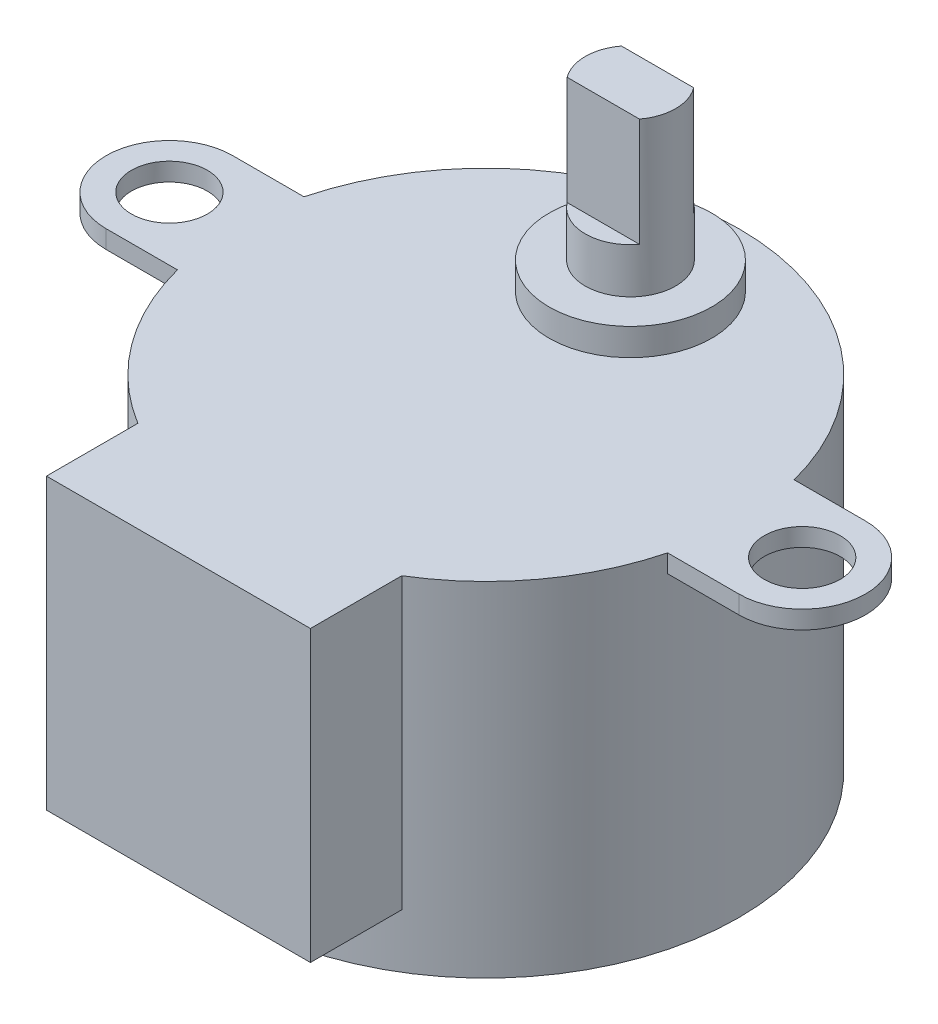
ISO-10303-21;
HEADER;
FILE_DESCRIPTION(('STEP AP214'),'2;1');
FILE_NAME('part.step','',(''),(''),'','','');
FILE_SCHEMA(('AUTOMOTIVE_DESIGN { 1 0 10303 214 1 1 1 1 }'));
ENDSEC;
DATA;
#1=APPLICATION_CONTEXT('core data for automotive mechanical design processes');
#2=APPLICATION_PROTOCOL_DEFINITION('international standard','automotive_design',2000,#1);
#3=PRODUCT_CONTEXT('',#1,'mechanical');
#4=PRODUCT('Part','Part','',(#3));
#5=PRODUCT_RELATED_PRODUCT_CATEGORY('part','',(#4));
#6=PRODUCT_DEFINITION_FORMATION('','',#4);
#7=PRODUCT_DEFINITION_CONTEXT('part definition',#1,'design');
#8=PRODUCT_DEFINITION('design','',#6,#7);
#9=PRODUCT_DEFINITION_SHAPE('','',#8);
#10=(LENGTH_UNIT() NAMED_UNIT(*) SI_UNIT(.MILLI.,.METRE.));
#11=(NAMED_UNIT(*) PLANE_ANGLE_UNIT() SI_UNIT($,.RADIAN.));
#12=(NAMED_UNIT(*) SI_UNIT($,.STERADIAN.) SOLID_ANGLE_UNIT());
#13=UNCERTAINTY_MEASURE_WITH_UNIT(LENGTH_MEASURE(1.E-05),#10,'distance_accuracy_value','');
#14=(GEOMETRIC_REPRESENTATION_CONTEXT(3) GLOBAL_UNCERTAINTY_ASSIGNED_CONTEXT((#13)) GLOBAL_UNIT_ASSIGNED_CONTEXT((#10,
#11,#12)) REPRESENTATION_CONTEXT('',''));
#15=CARTESIAN_POINT('',(0.,0.,0.));
#16=DIRECTION('',(0.,0.,1.));
#17=DIRECTION('',(1.,0.,0.));
#18=AXIS2_PLACEMENT_3D('',#15,#16,#17);
#19=CARTESIAN_POINT('',(0.,23.,-8.00000000000001));
#20=DIRECTION('',(0.,1.,0.));
#21=DIRECTION('',(0.,0.,1.));
#22=AXIS2_PLACEMENT_3D('',#19,#20,#21);
#23=PLANE('',#22);
#24=DIRECTION('',(-1.,0.,0.));
#25=VECTOR('',#24,1.);
#26=CARTESIAN_POINT('',(-2.,23.,-9.49999999999999));
#27=LINE('',#26,#25);
#28=CARTESIAN_POINT('',(2.,23.,-9.49999999999999));
#29=VERTEX_POINT('',#28);
#30=CARTESIAN_POINT('',(-2.,23.,-9.49999999999999));
#31=VERTEX_POINT('',#30);
#32=EDGE_CURVE('E171',#29,#31,#27,.T.);
#33=ORIENTED_EDGE('',*,*,#32,.F.);
#34=CARTESIAN_POINT('',(0.,23.,-8.00000000000001));
#35=DIRECTION('',(0.,1.,0.));
#36=DIRECTION('',(0.,0.,1.));
#37=AXIS2_PLACEMENT_3D('',#34,#35,#36);
#38=CIRCLE('',#37,2.5);
#39=EDGE_CURVE('E60',#29,#31,#38,.T.);
#40=ORIENTED_EDGE('',*,*,#39,.T.);
#41=EDGE_LOOP('',(#33,#40));
#42=FACE_BOUND('',#41,.T.);
#43=ADVANCED_FACE('F37',(#42),#23,.T.);
#44=CARTESIAN_POINT('',(0.,19.,0.));
#45=DIRECTION('',(0.,-1.,0.));
#46=DIRECTION('',(0.,0.,-1.));
#47=AXIS2_PLACEMENT_3D('',#44,#45,#46);
#48=CYLINDRICAL_SURFACE('',#47,14.);
#49=CARTESIAN_POINT('',(0.,0.,0.));
#50=DIRECTION('',(0.,1.,0.));
#51=DIRECTION('',(0.,0.,1.));
#52=AXIS2_PLACEMENT_3D('',#49,#50,#51);
#53=CIRCLE('',#52,14.);
#54=CARTESIAN_POINT('',(0.,0.,14.));
#55=VERTEX_POINT('',#54);
#56=EDGE_CURVE('E41',#55,#55,#53,.T.);
#57=ORIENTED_EDGE('',*,*,#56,.T.);
#58=EDGE_LOOP('',(#57));
#59=FACE_BOUND('',#58,.T.);
#60=DIRECTION('',(0.,1.,0.));
#61=VECTOR('',#60,1.);
#62=CARTESIAN_POINT('',(7.3,3.,11.9461290801665));
#63=LINE('',#62,#61);
#64=CARTESIAN_POINT('',(7.3,3.,11.9461290801665));
#65=VERTEX_POINT('',#64);
#66=CARTESIAN_POINT('',(7.3,19.,11.9461290801665));
#67=VERTEX_POINT('',#66);
#68=EDGE_CURVE('E215',#65,#67,#63,.T.);
#69=ORIENTED_EDGE('',*,*,#68,.F.);
#70=CARTESIAN_POINT('',(0.,3.,0.));
#71=DIRECTION('',(0.,1.,0.));
#72=DIRECTION('',(0.,0.,1.));
#73=AXIS2_PLACEMENT_3D('',#70,#71,#72);
#74=CIRCLE('',#73,14.);
#75=CARTESIAN_POINT('',(-7.3,3.,11.9461290801665));
#76=VERTEX_POINT('',#75);
#77=EDGE_CURVE('E189',#76,#65,#74,.T.);
#78=ORIENTED_EDGE('',*,*,#77,.F.);
#79=DIRECTION('',(0.,1.,0.));
#80=VECTOR('',#79,1.);
#81=CARTESIAN_POINT('',(-7.3,3.,11.9461290801665));
#82=LINE('',#81,#80);
#83=CARTESIAN_POINT('',(-7.3,19.,11.9461290801665));
#84=VERTEX_POINT('',#83);
#85=EDGE_CURVE('E201',#76,#84,#82,.T.);
#86=ORIENTED_EDGE('',*,*,#85,.T.);
#87=CARTESIAN_POINT('',(0.,19.,0.));
#88=DIRECTION('',(0.,1.,0.));
#89=DIRECTION('',(0.,0.,1.));
#90=AXIS2_PLACEMENT_3D('',#87,#88,#89);
#91=CIRCLE('',#90,14.);
#92=CARTESIAN_POINT('',(-13.555441711726,19.,3.5));
#93=VERTEX_POINT('',#92);
#94=EDGE_CURVE('E289',#93,#84,#91,.T.);
#95=ORIENTED_EDGE('',*,*,#94,.F.);
#96=DIRECTION('',(0.,1.,0.));
#97=VECTOR('',#96,1.);
#98=CARTESIAN_POINT('',(-13.555441711726,18.,3.5));
#99=LINE('',#98,#97);
#100=CARTESIAN_POINT('',(-13.555441711726,18.,3.5));
#101=VERTEX_POINT('',#100);
#102=EDGE_CURVE('E256',#101,#93,#99,.T.);
#103=ORIENTED_EDGE('',*,*,#102,.F.);
#104=CARTESIAN_POINT('',(0.,18.,0.));
#105=DIRECTION('',(0.,-1.,0.));
#106=DIRECTION('',(0.,0.,-1.));
#107=AXIS2_PLACEMENT_3D('',#104,#105,#106);
#108=CIRCLE('',#107,14.);
#109=CARTESIAN_POINT('',(-13.555441711726,18.,-3.5));
#110=VERTEX_POINT('',#109);
#111=EDGE_CURVE('E237',#101,#110,#108,.T.);
#112=ORIENTED_EDGE('',*,*,#111,.T.);
#113=DIRECTION('',(0.,1.,0.));
#114=VECTOR('',#113,1.);
#115=CARTESIAN_POINT('',(-13.555441711726,18.,-3.5));
#116=LINE('',#115,#114);
#117=CARTESIAN_POINT('',(-13.555441711726,19.,-3.5));
#118=VERTEX_POINT('',#117);
#119=EDGE_CURVE('E253',#110,#118,#116,.T.);
#120=ORIENTED_EDGE('',*,*,#119,.T.);
#121=CARTESIAN_POINT('',(13.555441711726,19.,-3.5));
#122=VERTEX_POINT('',#121);
#123=EDGE_CURVE('E46',#122,#118,#91,.T.);
#124=ORIENTED_EDGE('',*,*,#123,.F.);
#125=DIRECTION('',(0.,1.,0.));
#126=VECTOR('',#125,1.);
#127=CARTESIAN_POINT('',(13.555441711726,18.,-3.5));
#128=LINE('',#127,#126);
#129=CARTESIAN_POINT('',(13.555441711726,18.,-3.5));
#130=VERTEX_POINT('',#129);
#131=EDGE_CURVE('E285',#130,#122,#128,.T.);
#132=ORIENTED_EDGE('',*,*,#131,.F.);
#133=CARTESIAN_POINT('',(0.,18.,0.));
#134=DIRECTION('',(0.,-1.,0.));
#135=DIRECTION('',(0.,0.,1.));
#136=AXIS2_PLACEMENT_3D('',#133,#134,#135);
#137=CIRCLE('',#136,14.);
#138=CARTESIAN_POINT('',(13.555441711726,18.,3.5));
#139=VERTEX_POINT('',#138);
#140=EDGE_CURVE('E267',#130,#139,#137,.T.);
#141=ORIENTED_EDGE('',*,*,#140,.T.);
#142=DIRECTION('',(0.,1.,0.));
#143=VECTOR('',#142,1.);
#144=CARTESIAN_POINT('',(13.555441711726,18.,3.5));
#145=LINE('',#144,#143);
#146=CARTESIAN_POINT('',(13.555441711726,19.,3.5));
#147=VERTEX_POINT('',#146);
#148=EDGE_CURVE('E282',#139,#147,#145,.T.);
#149=ORIENTED_EDGE('',*,*,#148,.T.);
#150=EDGE_CURVE('E290',#67,#147,#91,.T.);
#151=ORIENTED_EDGE('',*,*,#150,.F.);
#152=EDGE_LOOP('',(#69,#78,#86,#95,#103,#112,#120,#124,#132,#141,#149,#151));
#153=FACE_BOUND('',#152,.T.);
#154=ADVANCED_FACE('F39',(#59,#153),#48,.T.);
#155=CARTESIAN_POINT('',(0.,19.,0.));
#156=DIRECTION('',(0.,1.,0.));
#157=DIRECTION('',(0.,0.,1.));
#158=AXIS2_PLACEMENT_3D('',#155,#156,#157);
#159=PLANE('',#158);
#160=CARTESIAN_POINT('',(0.,19.,-8.00000000000001));
#161=DIRECTION('',(0.,1.,0.));
#162=DIRECTION('',(0.,0.,1.));
#163=AXIS2_PLACEMENT_3D('',#160,#161,#162);
#164=CIRCLE('',#163,4.5);
#165=CARTESIAN_POINT('',(0.,19.,-3.50000000000001));
#166=VERTEX_POINT('',#165);
#167=EDGE_CURVE('E186',#166,#166,#164,.T.);
#168=ORIENTED_EDGE('',*,*,#167,.F.);
#169=EDGE_LOOP('',(#168));
#170=FACE_BOUND('',#169,.T.);
#171=CARTESIAN_POINT('',(17.5,19.,0.));
#172=DIRECTION('',(0.,1.,0.));
#173=DIRECTION('',(0.,0.,1.));
#174=AXIS2_PLACEMENT_3D('',#171,#172,#173);
#175=CIRCLE('',#174,2.1);
#176=CARTESIAN_POINT('',(17.5,19.,2.1));
#177=VERTEX_POINT('',#176);
#178=EDGE_CURVE('E218',#177,#177,#175,.T.);
#179=ORIENTED_EDGE('',*,*,#178,.F.);
#180=EDGE_LOOP('',(#179));
#181=FACE_BOUND('',#180,.T.);
#182=CARTESIAN_POINT('',(-17.5,19.,0.));
#183=DIRECTION('',(0.,1.,0.));
#184=DIRECTION('',(0.,0.,1.));
#185=AXIS2_PLACEMENT_3D('',#182,#183,#184);
#186=CIRCLE('',#185,2.1);
#187=CARTESIAN_POINT('',(-17.5,19.,2.1));
#188=VERTEX_POINT('',#187);
#189=EDGE_CURVE('E222',#188,#188,#186,.T.);
#190=ORIENTED_EDGE('',*,*,#189,.F.);
#191=EDGE_LOOP('',(#190));
#192=FACE_BOUND('',#191,.T.);
#193=ORIENTED_EDGE('',*,*,#123,.T.);
#194=DIRECTION('',(-1.,0.,0.));
#195=VECTOR('',#194,1.);
#196=CARTESIAN_POINT('',(-13.555441711726,19.,-3.5));
#197=LINE('',#196,#195);
#198=CARTESIAN_POINT('',(-17.5,19.,-3.5));
#199=VERTEX_POINT('',#198);
#200=EDGE_CURVE('E234',#118,#199,#197,.T.);
#201=ORIENTED_EDGE('',*,*,#200,.T.);
#202=CARTESIAN_POINT('',(-17.5,19.,0.));
#203=DIRECTION('',(0.,1.,0.));
#204=DIRECTION('',(0.,0.,-1.));
#205=AXIS2_PLACEMENT_3D('',#202,#203,#204);
#206=CIRCLE('',#205,3.5);
#207=CARTESIAN_POINT('',(-17.5,19.,3.5));
#208=VERTEX_POINT('',#207);
#209=EDGE_CURVE('E225',#199,#208,#206,.T.);
#210=ORIENTED_EDGE('',*,*,#209,.T.);
#211=DIRECTION('',(1.,0.,0.));
#212=VECTOR('',#211,1.);
#213=CARTESIAN_POINT('',(-13.555441711726,19.,3.5));
#214=LINE('',#213,#212);
#215=EDGE_CURVE('E246',#208,#93,#214,.T.);
#216=ORIENTED_EDGE('',*,*,#215,.T.);
#217=ORIENTED_EDGE('',*,*,#94,.T.);
#218=DIRECTION('',(0.,0.,1.));
#219=VECTOR('',#218,1.);
#220=CARTESIAN_POINT('',(-7.3,19.,11.9461290801665));
#221=LINE('',#220,#219);
#222=CARTESIAN_POINT('',(-7.30000000000001,19.,17.));
#223=VERTEX_POINT('',#222);
#224=EDGE_CURVE('E193',#84,#223,#221,.T.);
#225=ORIENTED_EDGE('',*,*,#224,.T.);
#226=DIRECTION('',(1.,0.,0.));
#227=VECTOR('',#226,1.);
#228=CARTESIAN_POINT('',(-7.30000000000001,19.,17.));
#229=LINE('',#228,#227);
#230=CARTESIAN_POINT('',(7.3,19.,17.));
#231=VERTEX_POINT('',#230);
#232=EDGE_CURVE('E204',#223,#231,#229,.T.);
#233=ORIENTED_EDGE('',*,*,#232,.T.);
#234=DIRECTION('',(0.,0.,1.));
#235=VECTOR('',#234,1.);
#236=CARTESIAN_POINT('',(7.3,19.,11.9461290801665));
#237=LINE('',#236,#235);
#238=EDGE_CURVE('E185',#67,#231,#237,.T.);
#239=ORIENTED_EDGE('',*,*,#238,.F.);
#240=ORIENTED_EDGE('',*,*,#150,.T.);
#241=DIRECTION('',(1.,0.,0.));
#242=VECTOR('',#241,1.);
#243=CARTESIAN_POINT('',(13.555441711726,19.,3.5));
#244=LINE('',#243,#242);
#245=CARTESIAN_POINT('',(17.5,19.,3.5));
#246=VERTEX_POINT('',#245);
#247=EDGE_CURVE('E264',#147,#246,#244,.T.);
#248=ORIENTED_EDGE('',*,*,#247,.T.);
#249=CARTESIAN_POINT('',(17.5,19.,0.));
#250=DIRECTION('',(0.,1.,0.));
#251=DIRECTION('',(0.,0.,1.));
#252=AXIS2_PLACEMENT_3D('',#249,#250,#251);
#253=CIRCLE('',#252,3.5);
#254=CARTESIAN_POINT('',(17.5,19.,-3.5));
#255=VERTEX_POINT('',#254);
#256=EDGE_CURVE('E252',#246,#255,#253,.T.);
#257=ORIENTED_EDGE('',*,*,#256,.T.);
#258=DIRECTION('',(-1.,0.,0.));
#259=VECTOR('',#258,1.);
#260=CARTESIAN_POINT('',(13.555441711726,19.,-3.5));
#261=LINE('',#260,#259);
#262=EDGE_CURVE('E276',#255,#122,#261,.T.);
#263=ORIENTED_EDGE('',*,*,#262,.T.);
#264=EDGE_LOOP('',(#193,#201,#210,#216,#217,#225,#233,#239,#240,#248,#257,#263));
#265=FACE_BOUND('',#264,.T.);
#266=ADVANCED_FACE('F305',(#170,#181,#192,#265),#159,.T.);
#267=CARTESIAN_POINT('',(0.,0.,0.));
#268=DIRECTION('',(0.,1.,0.));
#269=DIRECTION('',(0.,0.,1.));
#270=AXIS2_PLACEMENT_3D('',#267,#268,#269);
#271=PLANE('',#270);
#272=ORIENTED_EDGE('',*,*,#56,.F.);
#273=EDGE_LOOP('',(#272));
#274=FACE_BOUND('',#273,.T.);
#275=ADVANCED_FACE('F302',(#274),#271,.F.);
#276=CARTESIAN_POINT('',(17.5,18.,0.));
#277=DIRECTION('',(0.,1.,0.));
#278=DIRECTION('',(0.,0.,1.));
#279=AXIS2_PLACEMENT_3D('',#276,#277,#278);
#280=CYLINDRICAL_SURFACE('',#279,3.5);
#281=ORIENTED_EDGE('',*,*,#256,.F.);
#282=DIRECTION('',(0.,1.,0.));
#283=VECTOR('',#282,1.);
#284=CARTESIAN_POINT('',(17.5,18.,3.5));
#285=LINE('',#284,#283);
#286=CARTESIAN_POINT('',(17.5,18.,3.5));
#287=VERTEX_POINT('',#286);
#288=EDGE_CURVE('E280',#287,#246,#285,.T.);
#289=ORIENTED_EDGE('',*,*,#288,.F.);
#290=CARTESIAN_POINT('',(17.5,18.,0.));
#291=DIRECTION('',(0.,1.,0.));
#292=DIRECTION('',(0.,0.,1.));
#293=AXIS2_PLACEMENT_3D('',#290,#291,#292);
#294=CIRCLE('',#293,3.5);
#295=CARTESIAN_POINT('',(17.5,18.,-3.5));
#296=VERTEX_POINT('',#295);
#297=EDGE_CURVE('E260',#287,#296,#294,.T.);
#298=ORIENTED_EDGE('',*,*,#297,.T.);
#299=DIRECTION('',(0.,1.,0.));
#300=VECTOR('',#299,1.);
#301=CARTESIAN_POINT('',(17.5,18.,-3.5));
#302=LINE('',#301,#300);
#303=EDGE_CURVE('E273',#296,#255,#302,.T.);
#304=ORIENTED_EDGE('',*,*,#303,.T.);
#305=EDGE_LOOP('',(#281,#289,#298,#304));
#306=FACE_BOUND('',#305,.T.);
#307=ADVANCED_FACE('F304',(#306),#280,.T.);
#308=CARTESIAN_POINT('',(13.555441711726,18.,3.5));
#309=DIRECTION('',(0.,0.,1.));
#310=DIRECTION('',(1.,0.,0.));
#311=AXIS2_PLACEMENT_3D('',#308,#309,#310);
#312=PLANE('',#311);
#313=ORIENTED_EDGE('',*,*,#247,.F.);
#314=ORIENTED_EDGE('',*,*,#148,.F.);
#315=DIRECTION('',(1.,0.,0.));
#316=VECTOR('',#315,1.);
#317=CARTESIAN_POINT('',(13.555441711726,18.,3.5));
#318=LINE('',#317,#316);
#319=EDGE_CURVE('E270',#139,#287,#318,.T.);
#320=ORIENTED_EDGE('',*,*,#319,.T.);
#321=ORIENTED_EDGE('',*,*,#288,.T.);
#322=EDGE_LOOP('',(#313,#314,#320,#321));
#323=FACE_BOUND('',#322,.T.);
#324=ADVANCED_FACE('F310',(#323),#312,.T.);
#325=CARTESIAN_POINT('',(13.555441711726,18.,-3.5));
#326=DIRECTION('',(0.,0.,-1.));
#327=DIRECTION('',(-1.,0.,0.));
#328=AXIS2_PLACEMENT_3D('',#325,#326,#327);
#329=PLANE('',#328);
#330=ORIENTED_EDGE('',*,*,#262,.F.);
#331=ORIENTED_EDGE('',*,*,#303,.F.);
#332=DIRECTION('',(-1.,0.,0.));
#333=VECTOR('',#332,1.);
#334=CARTESIAN_POINT('',(13.555441711726,18.,-3.5));
#335=LINE('',#334,#333);
#336=EDGE_CURVE('E263',#296,#130,#335,.T.);
#337=ORIENTED_EDGE('',*,*,#336,.T.);
#338=ORIENTED_EDGE('',*,*,#131,.T.);
#339=EDGE_LOOP('',(#330,#331,#337,#338));
#340=FACE_BOUND('',#339,.T.);
#341=ADVANCED_FACE('F383',(#340),#329,.T.);
#342=CARTESIAN_POINT('',(17.5,18.,0.));
#343=DIRECTION('',(0.,1.,0.));
#344=DIRECTION('',(0.,0.,1.));
#345=AXIS2_PLACEMENT_3D('',#342,#343,#344);
#346=PLANE('',#345);
#347=CARTESIAN_POINT('',(17.5,18.,0.));
#348=DIRECTION('',(0.,1.,0.));
#349=DIRECTION('',(0.,0.,1.));
#350=AXIS2_PLACEMENT_3D('',#347,#348,#349);
#351=CIRCLE('',#350,2.1);
#352=CARTESIAN_POINT('',(17.5,18.,2.1));
#353=VERTEX_POINT('',#352);
#354=EDGE_CURVE('E221',#353,#353,#351,.F.);
#355=ORIENTED_EDGE('',*,*,#354,.F.);
#356=EDGE_LOOP('',(#355));
#357=FACE_BOUND('',#356,.T.);
#358=ORIENTED_EDGE('',*,*,#297,.F.);
#359=ORIENTED_EDGE('',*,*,#319,.F.);
#360=ORIENTED_EDGE('',*,*,#140,.F.);
#361=ORIENTED_EDGE('',*,*,#336,.F.);
#362=EDGE_LOOP('',(#358,#359,#360,#361));
#363=FACE_BOUND('',#362,.T.);
#364=ADVANCED_FACE('F379',(#357,#363),#346,.F.);
#365=CARTESIAN_POINT('',(-17.5,18.,0.));
#366=DIRECTION('',(0.,1.,0.));
#367=DIRECTION('',(0.,0.,1.));
#368=AXIS2_PLACEMENT_3D('',#365,#366,#367);
#369=CYLINDRICAL_SURFACE('',#368,3.5);
#370=ORIENTED_EDGE('',*,*,#209,.F.);
#371=DIRECTION('',(0.,1.,0.));
#372=VECTOR('',#371,1.);
#373=CARTESIAN_POINT('',(-17.5,18.,-3.5));
#374=LINE('',#373,#372);
#375=CARTESIAN_POINT('',(-17.5,18.,-3.5));
#376=VERTEX_POINT('',#375);
#377=EDGE_CURVE('E250',#376,#199,#374,.T.);
#378=ORIENTED_EDGE('',*,*,#377,.F.);
#379=CARTESIAN_POINT('',(-17.5,18.,0.));
#380=DIRECTION('',(0.,1.,0.));
#381=DIRECTION('',(0.,0.,-1.));
#382=AXIS2_PLACEMENT_3D('',#379,#380,#381);
#383=CIRCLE('',#382,3.5);
#384=CARTESIAN_POINT('',(-17.5,18.,3.5));
#385=VERTEX_POINT('',#384);
#386=EDGE_CURVE('E230',#376,#385,#383,.T.);
#387=ORIENTED_EDGE('',*,*,#386,.T.);
#388=DIRECTION('',(0.,1.,0.));
#389=VECTOR('',#388,1.);
#390=CARTESIAN_POINT('',(-17.5,18.,3.5));
#391=LINE('',#390,#389);
#392=EDGE_CURVE('E243',#385,#208,#391,.T.);
#393=ORIENTED_EDGE('',*,*,#392,.T.);
#394=EDGE_LOOP('',(#370,#378,#387,#393));
#395=FACE_BOUND('',#394,.T.);
#396=ADVANCED_FACE('F372',(#395),#369,.T.);
#397=CARTESIAN_POINT('',(-13.555441711726,18.,-3.5));
#398=DIRECTION('',(0.,0.,-1.));
#399=DIRECTION('',(-1.,0.,0.));
#400=AXIS2_PLACEMENT_3D('',#397,#398,#399);
#401=PLANE('',#400);
#402=ORIENTED_EDGE('',*,*,#200,.F.);
#403=ORIENTED_EDGE('',*,*,#119,.F.);
#404=DIRECTION('',(-1.,0.,0.));
#405=VECTOR('',#404,1.);
#406=CARTESIAN_POINT('',(-13.555441711726,18.,-3.5));
#407=LINE('',#406,#405);
#408=EDGE_CURVE('E240',#110,#376,#407,.T.);
#409=ORIENTED_EDGE('',*,*,#408,.T.);
#410=ORIENTED_EDGE('',*,*,#377,.T.);
#411=EDGE_LOOP('',(#402,#403,#409,#410));
#412=FACE_BOUND('',#411,.T.);
#413=ADVANCED_FACE('F369',(#412),#401,.T.);
#414=CARTESIAN_POINT('',(-13.555441711726,18.,3.5));
#415=DIRECTION('',(0.,0.,1.));
#416=DIRECTION('',(1.,0.,0.));
#417=AXIS2_PLACEMENT_3D('',#414,#415,#416);
#418=PLANE('',#417);
#419=ORIENTED_EDGE('',*,*,#215,.F.);
#420=ORIENTED_EDGE('',*,*,#392,.F.);
#421=DIRECTION('',(1.,0.,0.));
#422=VECTOR('',#421,1.);
#423=CARTESIAN_POINT('',(-13.555441711726,18.,3.5));
#424=LINE('',#423,#422);
#425=EDGE_CURVE('E233',#385,#101,#424,.T.);
#426=ORIENTED_EDGE('',*,*,#425,.T.);
#427=ORIENTED_EDGE('',*,*,#102,.T.);
#428=EDGE_LOOP('',(#419,#420,#426,#427));
#429=FACE_BOUND('',#428,.T.);
#430=ADVANCED_FACE('F367',(#429),#418,.T.);
#431=CARTESIAN_POINT('',(-17.5,18.,0.));
#432=DIRECTION('',(0.,-1.,0.));
#433=DIRECTION('',(0.,0.,-1.));
#434=AXIS2_PLACEMENT_3D('',#431,#432,#433);
#435=PLANE('',#434);
#436=CARTESIAN_POINT('',(-17.5,18.,0.));
#437=DIRECTION('',(0.,-1.,0.));
#438=DIRECTION('',(0.,0.,-1.));
#439=AXIS2_PLACEMENT_3D('',#436,#437,#438);
#440=CIRCLE('',#439,2.1);
#441=CARTESIAN_POINT('',(-17.5,18.,-2.1));
#442=VERTEX_POINT('',#441);
#443=EDGE_CURVE('E217',#442,#442,#440,.F.);
#444=ORIENTED_EDGE('',*,*,#443,.T.);
#445=EDGE_LOOP('',(#444));
#446=FACE_BOUND('',#445,.T.);
#447=ORIENTED_EDGE('',*,*,#386,.F.);
#448=ORIENTED_EDGE('',*,*,#408,.F.);
#449=ORIENTED_EDGE('',*,*,#111,.F.);
#450=ORIENTED_EDGE('',*,*,#425,.F.);
#451=EDGE_LOOP('',(#447,#448,#449,#450));
#452=FACE_BOUND('',#451,.T.);
#453=ADVANCED_FACE('F363',(#446,#452),#435,.T.);
#454=CARTESIAN_POINT('',(-17.5,-0.001000000000001,0.));
#455=DIRECTION('',(0.,1.,0.));
#456=DIRECTION('',(0.,0.,1.));
#457=AXIS2_PLACEMENT_3D('',#454,#455,#456);
#458=CYLINDRICAL_SURFACE('',#457,2.1);
#459=ORIENTED_EDGE('',*,*,#443,.F.);
#460=EDGE_LOOP('',(#459));
#461=FACE_BOUND('',#460,.T.);
#462=ORIENTED_EDGE('',*,*,#189,.T.);
#463=EDGE_LOOP('',(#462));
#464=FACE_BOUND('',#463,.T.);
#465=ADVANCED_FACE('F359',(#461,#464),#458,.F.);
#466=CARTESIAN_POINT('',(17.5,-0.001000000000001,0.));
#467=DIRECTION('',(0.,1.,0.));
#468=DIRECTION('',(0.,0.,1.));
#469=AXIS2_PLACEMENT_3D('',#466,#467,#468);
#470=CYLINDRICAL_SURFACE('',#469,2.1);
#471=ORIENTED_EDGE('',*,*,#178,.T.);
#472=EDGE_LOOP('',(#471));
#473=FACE_BOUND('',#472,.T.);
#474=ORIENTED_EDGE('',*,*,#354,.T.);
#475=EDGE_LOOP('',(#474));
#476=FACE_BOUND('',#475,.T.);
#477=ADVANCED_FACE('F355',(#473,#476),#470,.F.);
#478=CARTESIAN_POINT('',(7.3,3.,11.9461290801665));
#479=DIRECTION('',(-1.,0.,0.));
#480=DIRECTION('',(0.,0.,1.));
#481=AXIS2_PLACEMENT_3D('',#478,#479,#480);
#482=PLANE('',#481);
#483=ORIENTED_EDGE('',*,*,#238,.T.);
#484=DIRECTION('',(0.,1.,0.));
#485=VECTOR('',#484,1.);
#486=CARTESIAN_POINT('',(7.3,3.,17.));
#487=LINE('',#486,#485);
#488=CARTESIAN_POINT('',(7.3,3.,17.));
#489=VERTEX_POINT('',#488);
#490=EDGE_CURVE('E213',#489,#231,#487,.T.);
#491=ORIENTED_EDGE('',*,*,#490,.F.);
#492=DIRECTION('',(0.,0.,1.));
#493=VECTOR('',#492,1.);
#494=CARTESIAN_POINT('',(7.3,3.,11.9461290801665));
#495=LINE('',#494,#493);
#496=EDGE_CURVE('E192',#65,#489,#495,.T.);
#497=ORIENTED_EDGE('',*,*,#496,.F.);
#498=ORIENTED_EDGE('',*,*,#68,.T.);
#499=EDGE_LOOP('',(#483,#491,#497,#498));
#500=FACE_BOUND('',#499,.T.);
#501=ADVANCED_FACE('F351',(#500),#482,.F.);
#502=CARTESIAN_POINT('',(-7.30000000000001,3.,17.));
#503=DIRECTION('',(0.,0.,1.));
#504=DIRECTION('',(1.,0.,0.));
#505=AXIS2_PLACEMENT_3D('',#502,#503,#504);
#506=PLANE('',#505);
#507=ORIENTED_EDGE('',*,*,#232,.F.);
#508=DIRECTION('',(0.,1.,0.));
#509=VECTOR('',#508,1.);
#510=CARTESIAN_POINT('',(-7.30000000000001,3.,17.));
#511=LINE('',#510,#509);
#512=CARTESIAN_POINT('',(-7.30000000000001,3.,17.));
#513=VERTEX_POINT('',#512);
#514=EDGE_CURVE('E211',#513,#223,#511,.T.);
#515=ORIENTED_EDGE('',*,*,#514,.F.);
#516=DIRECTION('',(1.,0.,0.));
#517=VECTOR('',#516,1.);
#518=CARTESIAN_POINT('',(-7.30000000000001,3.,17.));
#519=LINE('',#518,#517);
#520=EDGE_CURVE('E195',#513,#489,#519,.T.);
#521=ORIENTED_EDGE('',*,*,#520,.T.);
#522=ORIENTED_EDGE('',*,*,#490,.T.);
#523=EDGE_LOOP('',(#507,#515,#521,#522));
#524=FACE_BOUND('',#523,.T.);
#525=ADVANCED_FACE('F347',(#524),#506,.T.);
#526=CARTESIAN_POINT('',(-7.3,3.,11.9461290801665));
#527=DIRECTION('',(-1.,0.,0.));
#528=DIRECTION('',(0.,0.,1.));
#529=AXIS2_PLACEMENT_3D('',#526,#527,#528);
#530=PLANE('',#529);
#531=ORIENTED_EDGE('',*,*,#224,.F.);
#532=ORIENTED_EDGE('',*,*,#85,.F.);
#533=DIRECTION('',(0.,0.,1.));
#534=VECTOR('',#533,1.);
#535=CARTESIAN_POINT('',(-7.3,3.,11.9461290801665));
#536=LINE('',#535,#534);
#537=EDGE_CURVE('E198',#76,#513,#536,.T.);
#538=ORIENTED_EDGE('',*,*,#537,.T.);
#539=ORIENTED_EDGE('',*,*,#514,.T.);
#540=EDGE_LOOP('',(#531,#532,#538,#539));
#541=FACE_BOUND('',#540,.T.);
#542=ADVANCED_FACE('F343',(#541),#530,.T.);
#543=CARTESIAN_POINT('',(0.,3.,0.));
#544=DIRECTION('',(0.,1.,0.));
#545=DIRECTION('',(0.,0.,1.));
#546=AXIS2_PLACEMENT_3D('',#543,#544,#545);
#547=PLANE('',#546);
#548=ORIENTED_EDGE('',*,*,#77,.T.);
#549=ORIENTED_EDGE('',*,*,#496,.T.);
#550=ORIENTED_EDGE('',*,*,#520,.F.);
#551=ORIENTED_EDGE('',*,*,#537,.F.);
#552=EDGE_LOOP('',(#548,#549,#550,#551));
#553=FACE_BOUND('',#552,.T.);
#554=ADVANCED_FACE('F339',(#553),#547,.F.);
#555=CARTESIAN_POINT('',(0.,20.5,-8.00000000000001));
#556=DIRECTION('',(0.,-1.,0.));
#557=DIRECTION('',(0.,0.,-1.));
#558=AXIS2_PLACEMENT_3D('',#555,#556,#557);
#559=CYLINDRICAL_SURFACE('',#558,4.5);
#560=CARTESIAN_POINT('',(0.,20.5,-8.00000000000001));
#561=DIRECTION('',(0.,1.,0.));
#562=DIRECTION('',(0.,0.,1.));
#563=AXIS2_PLACEMENT_3D('',#560,#561,#562);
#564=CIRCLE('',#563,4.5);
#565=CARTESIAN_POINT('',(0.,20.5,-3.50000000000001));
#566=VERTEX_POINT('',#565);
#567=EDGE_CURVE('E182',#566,#566,#564,.T.);
#568=ORIENTED_EDGE('',*,*,#567,.F.);
#569=EDGE_LOOP('',(#568));
#570=FACE_BOUND('',#569,.T.);
#571=ORIENTED_EDGE('',*,*,#167,.T.);
#572=EDGE_LOOP('',(#571));
#573=FACE_BOUND('',#572,.T.);
#574=ADVANCED_FACE('F333',(#570,#573),#559,.T.);
#575=CARTESIAN_POINT('',(0.,20.5,-8.00000000000001));
#576=DIRECTION('',(0.,1.,0.));
#577=DIRECTION('',(0.,0.,1.));
#578=AXIS2_PLACEMENT_3D('',#575,#576,#577);
#579=PLANE('',#578);
#580=CARTESIAN_POINT('',(0.,20.5,-8.00000000000001));
#581=DIRECTION('',(0.,1.,0.));
#582=DIRECTION('',(0.,0.,1.));
#583=AXIS2_PLACEMENT_3D('',#580,#581,#582);
#584=CIRCLE('',#583,2.5);
#585=CARTESIAN_POINT('',(0.,20.5,-5.50000000000001));
#586=VERTEX_POINT('',#585);
#587=EDGE_CURVE('E11',#586,#586,#584,.T.);
#588=ORIENTED_EDGE('',*,*,#587,.F.);
#589=EDGE_LOOP('',(#588));
#590=FACE_BOUND('',#589,.T.);
#591=ORIENTED_EDGE('',*,*,#567,.T.);
#592=EDGE_LOOP('',(#591));
#593=FACE_BOUND('',#592,.T.);
#594=ADVANCED_FACE('F329',(#590,#593),#579,.T.);
#595=CARTESIAN_POINT('',(0.,23.,-8.00000000000001));
#596=DIRECTION('',(0.,-1.,0.));
#597=DIRECTION('',(0.,0.,-1.));
#598=AXIS2_PLACEMENT_3D('',#595,#596,#597);
#599=CYLINDRICAL_SURFACE('',#598,2.5);
#600=ORIENTED_EDGE('',*,*,#39,.F.);
#601=DIRECTION('',(0.,-1.,0.));
#602=VECTOR('',#601,1.);
#603=CARTESIAN_POINT('',(2.,29.,-9.49999999999999));
#604=LINE('',#603,#602);
#605=CARTESIAN_POINT('',(2.,29.,-9.49999999999999));
#606=VERTEX_POINT('',#605);
#607=EDGE_CURVE('E178',#606,#29,#604,.T.);
#608=ORIENTED_EDGE('',*,*,#607,.F.);
#609=CARTESIAN_POINT('',(0.,29.,-8.00000000000001));
#610=DIRECTION('',(0.,1.,0.));
#611=DIRECTION('',(0.,0.,1.));
#612=AXIS2_PLACEMENT_3D('',#609,#610,#611);
#613=CIRCLE('',#612,2.5);
#614=CARTESIAN_POINT('',(2.,29.,-6.50000000000001));
#615=VERTEX_POINT('',#614);
#616=EDGE_CURVE('E161',#615,#606,#613,.T.);
#617=ORIENTED_EDGE('',*,*,#616,.F.);
#618=DIRECTION('',(0.,-1.,0.));
#619=VECTOR('',#618,1.);
#620=CARTESIAN_POINT('',(2.,29.,-6.50000000000001));
#621=LINE('',#620,#619);
#622=CARTESIAN_POINT('',(2.,23.,-6.50000000000001));
#623=VERTEX_POINT('',#622);
#624=EDGE_CURVE('E158',#615,#623,#621,.T.);
#625=ORIENTED_EDGE('',*,*,#624,.T.);
#626=CARTESIAN_POINT('',(-2.,23.,-6.50000000000001));
#627=VERTEX_POINT('',#626);
#628=EDGE_CURVE('E175',#627,#623,#38,.T.);
#629=ORIENTED_EDGE('',*,*,#628,.F.);
#630=DIRECTION('',(0.,-1.,0.));
#631=VECTOR('',#630,1.);
#632=CARTESIAN_POINT('',(-2.,29.,-6.50000000000001));
#633=LINE('',#632,#631);
#634=CARTESIAN_POINT('',(-2.,29.,-6.50000000000001));
#635=VERTEX_POINT('',#634);
#636=EDGE_CURVE('E156',#635,#627,#633,.T.);
#637=ORIENTED_EDGE('',*,*,#636,.F.);
#638=CARTESIAN_POINT('',(0.,29.,-8.00000000000001));
#639=DIRECTION('',(0.,1.,0.));
#640=DIRECTION('',(0.,0.,1.));
#641=AXIS2_PLACEMENT_3D('',#638,#639,#640);
#642=CIRCLE('',#641,2.5);
#643=CARTESIAN_POINT('',(-2.,29.,-9.49999999999999));
#644=VERTEX_POINT('',#643);
#645=EDGE_CURVE('E162',#644,#635,#642,.T.);
#646=ORIENTED_EDGE('',*,*,#645,.F.);
#647=DIRECTION('',(0.,-1.,0.));
#648=VECTOR('',#647,1.);
#649=CARTESIAN_POINT('',(-2.,29.,-9.49999999999999));
#650=LINE('',#649,#648);
#651=EDGE_CURVE('E518',#644,#31,#650,.T.);
#652=ORIENTED_EDGE('',*,*,#651,.T.);
#653=EDGE_LOOP('',(#600,#608,#617,#625,#629,#637,#646,#652));
#654=FACE_BOUND('',#653,.T.);
#655=ORIENTED_EDGE('',*,*,#587,.T.);
#656=EDGE_LOOP('',(#655));
#657=FACE_BOUND('',#656,.T.);
#658=ADVANCED_FACE('F173',(#654,#657),#599,.T.);
#659=DIRECTION('',(1.,0.,0.));
#660=VECTOR('',#659,1.);
#661=CARTESIAN_POINT('',(-2.,23.,-6.50000000000001));
#662=LINE('',#661,#660);
#663=EDGE_CURVE('E53',#627,#623,#662,.T.);
#664=ORIENTED_EDGE('',*,*,#663,.F.);
#665=ORIENTED_EDGE('',*,*,#628,.T.);
#666=EDGE_LOOP('',(#664,#665));
#667=FACE_BOUND('',#666,.T.);
#668=ADVANCED_FACE('F317',(#667),#23,.T.);
#669=CARTESIAN_POINT('',(-2.,29.,-6.50000000000001));
#670=DIRECTION('',(0.,0.,-1.));
#671=DIRECTION('',(-1.,0.,0.));
#672=AXIS2_PLACEMENT_3D('',#669,#670,#671);
#673=PLANE('',#672);
#674=ORIENTED_EDGE('',*,*,#663,.T.);
#675=ORIENTED_EDGE('',*,*,#624,.F.);
#676=DIRECTION('',(1.,0.,0.));
#677=VECTOR('',#676,1.);
#678=CARTESIAN_POINT('',(-2.,29.,-6.50000000000001));
#679=LINE('',#678,#677);
#680=EDGE_CURVE('E152',#635,#615,#679,.T.);
#681=ORIENTED_EDGE('',*,*,#680,.F.);
#682=ORIENTED_EDGE('',*,*,#636,.T.);
#683=EDGE_LOOP('',(#674,#675,#681,#682));
#684=FACE_BOUND('',#683,.T.);
#685=ADVANCED_FACE('F154',(#684),#673,.F.);
#686=CARTESIAN_POINT('',(-2.,29.,-9.49999999999999));
#687=DIRECTION('',(0.,0.,1.));
#688=DIRECTION('',(1.,0.,0.));
#689=AXIS2_PLACEMENT_3D('',#686,#687,#688);
#690=PLANE('',#689);
#691=ORIENTED_EDGE('',*,*,#32,.T.);
#692=ORIENTED_EDGE('',*,*,#651,.F.);
#693=DIRECTION('',(-1.,0.,0.));
#694=VECTOR('',#693,1.);
#695=CARTESIAN_POINT('',(-2.,29.,-9.49999999999999));
#696=LINE('',#695,#694);
#697=EDGE_CURVE('E167',#606,#644,#696,.T.);
#698=ORIENTED_EDGE('',*,*,#697,.F.);
#699=ORIENTED_EDGE('',*,*,#607,.T.);
#700=EDGE_LOOP('',(#691,#692,#698,#699));
#701=FACE_BOUND('',#700,.T.);
#702=ADVANCED_FACE('F328',(#701),#690,.F.);
#703=CARTESIAN_POINT('',(0.,29.,-8.00000000000001));
#704=DIRECTION('',(0.,1.,0.));
#705=DIRECTION('',(0.,0.,1.));
#706=AXIS2_PLACEMENT_3D('',#703,#704,#705);
#707=PLANE('',#706);
#708=ORIENTED_EDGE('',*,*,#645,.T.);
#709=ORIENTED_EDGE('',*,*,#680,.T.);
#710=ORIENTED_EDGE('',*,*,#616,.T.);
#711=ORIENTED_EDGE('',*,*,#697,.T.);
#712=EDGE_LOOP('',(#708,#709,#710,#711));
#713=FACE_BOUND('',#712,.T.);
#714=ADVANCED_FACE('F165',(#713),#707,.T.);
#715=CLOSED_SHELL('',(#43,#154,#266,#275,#307,#324,#341,#364,#396,#413,#430,#453,#465,#477,#501,
#525,#542,#554,#574,#594,#658,#668,#685,#702,#714));
#716=MANIFOLD_SOLID_BREP('B2',#715);
#717=ADVANCED_BREP_SHAPE_REPRESENTATION('',(#18,#716),#14);
#718=SHAPE_DEFINITION_REPRESENTATION(#9,#717);
ENDSEC;
END-ISO-10303-21;
